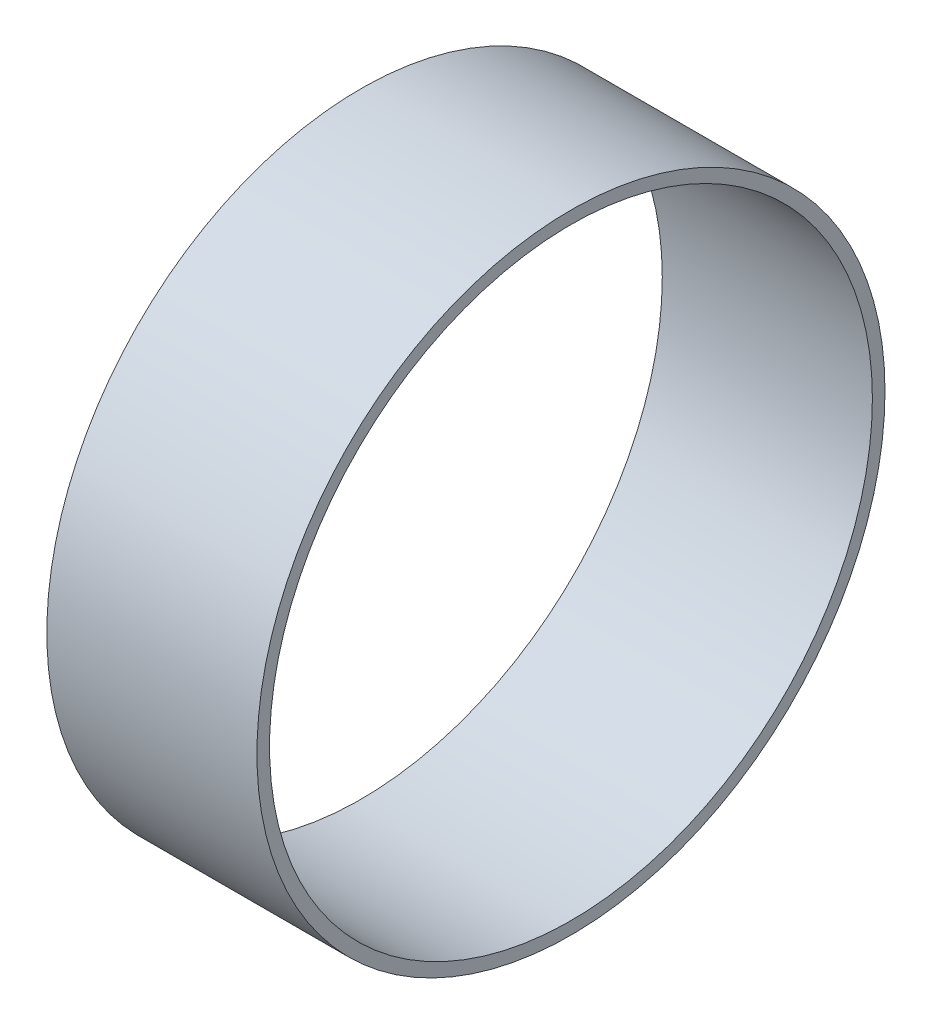
ISO-10303-21;
HEADER;
FILE_DESCRIPTION(('STEP AP214'),'2;1');
FILE_NAME('part.step','',(''),(''),'','','');
FILE_SCHEMA(('AUTOMOTIVE_DESIGN { 1 0 10303 214 1 1 1 1 }'));
ENDSEC;
DATA;
#1=APPLICATION_CONTEXT('core data for automotive mechanical design processes');
#2=APPLICATION_PROTOCOL_DEFINITION('international standard','automotive_design',2000,#1);
#3=PRODUCT_CONTEXT('',#1,'mechanical');
#4=PRODUCT('Part','Part','',(#3));
#5=PRODUCT_RELATED_PRODUCT_CATEGORY('part','',(#4));
#6=PRODUCT_DEFINITION_FORMATION('','',#4);
#7=PRODUCT_DEFINITION_CONTEXT('part definition',#1,'design');
#8=PRODUCT_DEFINITION('design','',#6,#7);
#9=PRODUCT_DEFINITION_SHAPE('','',#8);
#10=(LENGTH_UNIT() NAMED_UNIT(*) SI_UNIT(.MILLI.,.METRE.));
#11=(NAMED_UNIT(*) PLANE_ANGLE_UNIT() SI_UNIT($,.RADIAN.));
#12=(NAMED_UNIT(*) SI_UNIT($,.STERADIAN.) SOLID_ANGLE_UNIT());
#13=UNCERTAINTY_MEASURE_WITH_UNIT(LENGTH_MEASURE(1.E-05),#10,'distance_accuracy_value','');
#14=(GEOMETRIC_REPRESENTATION_CONTEXT(3) GLOBAL_UNCERTAINTY_ASSIGNED_CONTEXT((#13)) GLOBAL_UNIT_ASSIGNED_CONTEXT((#10,
#11,#12)) REPRESENTATION_CONTEXT('',''));
#15=CARTESIAN_POINT('',(0.,0.,0.));
#16=DIRECTION('',(0.,0.,1.));
#17=DIRECTION('',(1.,0.,0.));
#18=AXIS2_PLACEMENT_3D('',#15,#16,#17);
#19=CARTESIAN_POINT('',(9.525,0.,0.));
#20=DIRECTION('',(1.,0.,0.));
#21=DIRECTION('',(0.,0.,-1.));
#22=AXIS2_PLACEMENT_3D('',#19,#20,#21);
#23=PLANE('',#22);
#24=CARTESIAN_POINT('',(9.525,0.,0.));
#25=DIRECTION('',(1.,0.,0.));
#26=DIRECTION('',(0.,0.,-1.));
#27=AXIS2_PLACEMENT_3D('',#24,#25,#26);
#28=CIRCLE('',#27,28.4734);
#29=CARTESIAN_POINT('',(9.525,0.,-28.4734));
#30=VERTEX_POINT('',#29);
#31=EDGE_CURVE('E10',#30,#30,#28,.T.);
#32=ORIENTED_EDGE('',*,*,#31,.T.);
#33=EDGE_LOOP('',(#32));
#34=FACE_BOUND('',#33,.T.);
#35=CARTESIAN_POINT('',(9.525,0.,0.));
#36=DIRECTION('',(1.,0.,0.));
#37=DIRECTION('',(0.,0.,-1.));
#38=AXIS2_PLACEMENT_3D('',#35,#36,#37);
#39=CIRCLE('',#38,27.3304);
#40=CARTESIAN_POINT('',(9.525,0.,-27.3304));
#41=VERTEX_POINT('',#40);
#42=EDGE_CURVE('E54',#41,#41,#39,.T.);
#43=ORIENTED_EDGE('',*,*,#42,.F.);
#44=EDGE_LOOP('',(#43));
#45=FACE_BOUND('',#44,.T.);
#46=ADVANCED_FACE('F41',(#34,#45),#23,.T.);
#47=CARTESIAN_POINT('',(-9.525,0.,0.));
#48=DIRECTION('',(1.,0.,0.));
#49=DIRECTION('',(0.,0.,-1.));
#50=AXIS2_PLACEMENT_3D('',#47,#48,#49);
#51=PLANE('',#50);
#52=CARTESIAN_POINT('',(-9.525,0.,0.));
#53=DIRECTION('',(1.,0.,0.));
#54=DIRECTION('',(0.,0.,-1.));
#55=AXIS2_PLACEMENT_3D('',#52,#53,#54);
#56=CIRCLE('',#55,28.4734);
#57=CARTESIAN_POINT('',(-9.525,0.,-28.4734));
#58=VERTEX_POINT('',#57);
#59=EDGE_CURVE('E45',#58,#58,#56,.T.);
#60=ORIENTED_EDGE('',*,*,#59,.F.);
#61=EDGE_LOOP('',(#60));
#62=FACE_BOUND('',#61,.T.);
#63=CARTESIAN_POINT('',(-9.525,0.,0.));
#64=DIRECTION('',(1.,0.,0.));
#65=DIRECTION('',(0.,0.,-1.));
#66=AXIS2_PLACEMENT_3D('',#63,#64,#65);
#67=CIRCLE('',#66,27.3304);
#68=CARTESIAN_POINT('',(-9.525,0.,-27.3304));
#69=VERTEX_POINT('',#68);
#70=EDGE_CURVE('E56',#69,#69,#67,.T.);
#71=ORIENTED_EDGE('',*,*,#70,.T.);
#72=EDGE_LOOP('',(#71));
#73=FACE_BOUND('',#72,.T.);
#74=ADVANCED_FACE('F68',(#62,#73),#51,.F.);
#75=CARTESIAN_POINT('',(9.525,0.,0.));
#76=DIRECTION('',(-1.,0.,0.));
#77=DIRECTION('',(0.,0.,1.));
#78=AXIS2_PLACEMENT_3D('',#75,#76,#77);
#79=CYLINDRICAL_SURFACE('',#78,28.4734);
#80=ORIENTED_EDGE('',*,*,#31,.F.);
#81=EDGE_LOOP('',(#80));
#82=FACE_BOUND('',#81,.T.);
#83=ORIENTED_EDGE('',*,*,#59,.T.);
#84=EDGE_LOOP('',(#83));
#85=FACE_BOUND('',#84,.T.);
#86=ADVANCED_FACE('F43',(#82,#85),#79,.T.);
#87=CARTESIAN_POINT('',(9.525,0.,0.));
#88=DIRECTION('',(-1.,0.,0.));
#89=DIRECTION('',(0.,0.,1.));
#90=AXIS2_PLACEMENT_3D('',#87,#88,#89);
#91=CYLINDRICAL_SURFACE('',#90,27.3304);
#92=ORIENTED_EDGE('',*,*,#42,.T.);
#93=EDGE_LOOP('',(#92));
#94=FACE_BOUND('',#93,.T.);
#95=ORIENTED_EDGE('',*,*,#70,.F.);
#96=EDGE_LOOP('',(#95));
#97=FACE_BOUND('',#96,.T.);
#98=ADVANCED_FACE('F64',(#94,#97),#91,.F.);
#99=CLOSED_SHELL('',(#46,#74,#86,#98));
#100=MANIFOLD_SOLID_BREP('B2',#99);
#101=ADVANCED_BREP_SHAPE_REPRESENTATION('',(#18,#100),#14);
#102=SHAPE_DEFINITION_REPRESENTATION(#9,#101);
ENDSEC;
END-ISO-10303-21;
